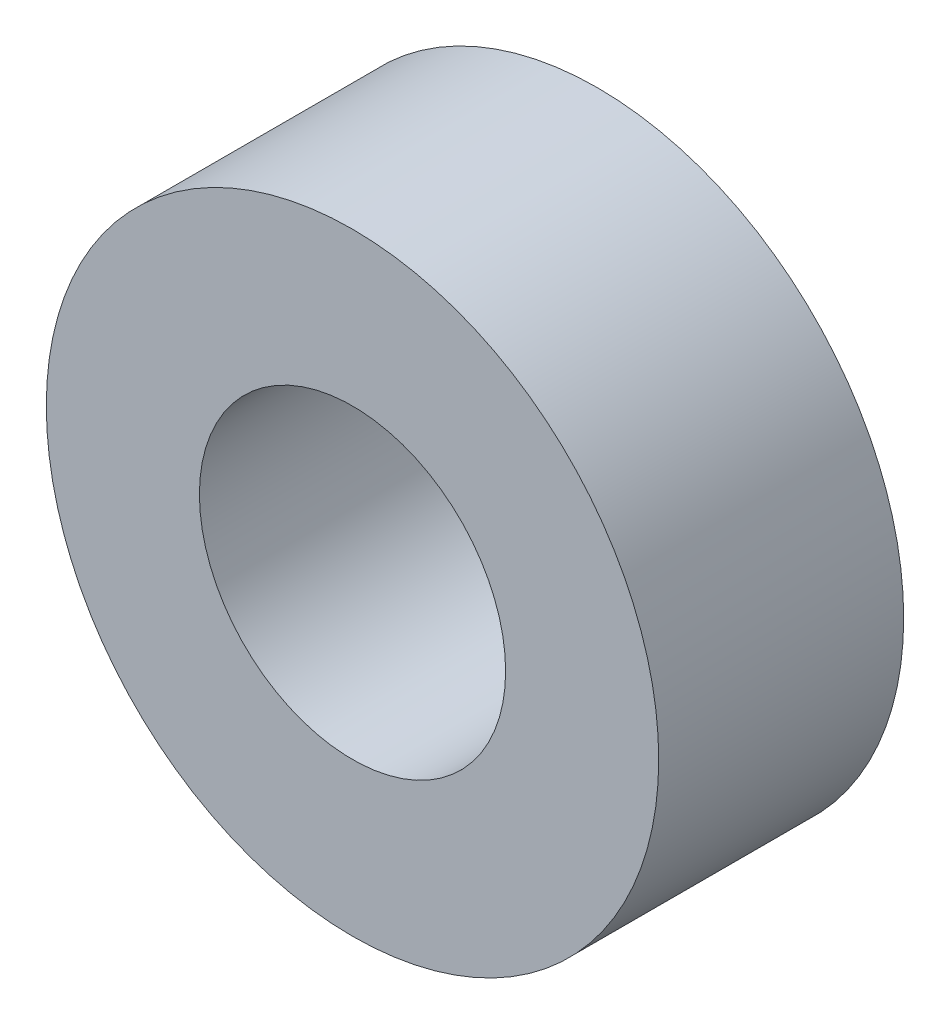
ISO-10303-21;
HEADER;
FILE_DESCRIPTION(('STEP AP214'),'2;1');
FILE_NAME('part.step','',(''),(''),'','','');
FILE_SCHEMA(('AUTOMOTIVE_DESIGN { 1 0 10303 214 1 1 1 1 }'));
ENDSEC;
DATA;
#1=APPLICATION_CONTEXT('core data for automotive mechanical design processes');
#2=APPLICATION_PROTOCOL_DEFINITION('international standard','automotive_design',2000,#1);
#3=PRODUCT_CONTEXT('',#1,'mechanical');
#4=PRODUCT('Part','Part','',(#3));
#5=PRODUCT_RELATED_PRODUCT_CATEGORY('part','',(#4));
#6=PRODUCT_DEFINITION_FORMATION('','',#4);
#7=PRODUCT_DEFINITION_CONTEXT('part definition',#1,'design');
#8=PRODUCT_DEFINITION('design','',#6,#7);
#9=PRODUCT_DEFINITION_SHAPE('','',#8);
#10=(LENGTH_UNIT() NAMED_UNIT(*) SI_UNIT(.MILLI.,.METRE.));
#11=(NAMED_UNIT(*) PLANE_ANGLE_UNIT() SI_UNIT($,.RADIAN.));
#12=(NAMED_UNIT(*) SI_UNIT($,.STERADIAN.) SOLID_ANGLE_UNIT());
#13=UNCERTAINTY_MEASURE_WITH_UNIT(LENGTH_MEASURE(1.E-05),#10,'distance_accuracy_value','');
#14=(GEOMETRIC_REPRESENTATION_CONTEXT(3) GLOBAL_UNCERTAINTY_ASSIGNED_CONTEXT((#13)) GLOBAL_UNIT_ASSIGNED_CONTEXT((#10,
#11,#12)) REPRESENTATION_CONTEXT('',''));
#15=CARTESIAN_POINT('',(0.,0.,0.));
#16=DIRECTION('',(0.,0.,1.));
#17=DIRECTION('',(1.,0.,0.));
#18=AXIS2_PLACEMENT_3D('',#15,#16,#17);
#19=CARTESIAN_POINT('',(0.,0.,0.));
#20=DIRECTION('',(0.,0.,1.));
#21=DIRECTION('',(1.,0.,0.));
#22=AXIS2_PLACEMENT_3D('',#19,#20,#21);
#23=PLANE('',#22);
#24=CARTESIAN_POINT('',(0.,0.,0.));
#25=DIRECTION('',(0.,0.,1.));
#26=DIRECTION('',(1.,0.,0.));
#27=AXIS2_PLACEMENT_3D('',#24,#25,#26);
#28=CIRCLE('',#27,5.);
#29=CARTESIAN_POINT('',(5.,0.,0.));
#30=VERTEX_POINT('',#29);
#31=EDGE_CURVE('E39',#30,#30,#28,.T.);
#32=ORIENTED_EDGE('',*,*,#31,.F.);
#33=EDGE_LOOP('',(#32));
#34=FACE_BOUND('',#33,.T.);
#35=CARTESIAN_POINT('',(0.,0.,0.));
#36=DIRECTION('',(0.,0.,-1.));
#37=DIRECTION('',(-1.,0.,0.));
#38=AXIS2_PLACEMENT_3D('',#35,#36,#37);
#39=CIRCLE('',#38,2.5);
#40=CARTESIAN_POINT('',(-2.5,0.,0.));
#41=VERTEX_POINT('',#40);
#42=EDGE_CURVE('E45',#41,#41,#39,.T.);
#43=ORIENTED_EDGE('',*,*,#42,.F.);
#44=EDGE_LOOP('',(#43));
#45=FACE_BOUND('',#44,.T.);
#46=ADVANCED_FACE('F31',(#34,#45),#23,.F.);
#47=CARTESIAN_POINT('',(0.,0.,4.));
#48=DIRECTION('',(0.,0.,-1.));
#49=DIRECTION('',(-1.,0.,0.));
#50=AXIS2_PLACEMENT_3D('',#47,#48,#49);
#51=CYLINDRICAL_SURFACE('',#50,5.);
#52=CARTESIAN_POINT('',(0.,0.,4.));
#53=DIRECTION('',(0.,0.,1.));
#54=DIRECTION('',(1.,0.,0.));
#55=AXIS2_PLACEMENT_3D('',#52,#53,#54);
#56=CIRCLE('',#55,5.);
#57=CARTESIAN_POINT('',(5.,0.,4.));
#58=VERTEX_POINT('',#57);
#59=EDGE_CURVE('E10',#58,#58,#56,.T.);
#60=ORIENTED_EDGE('',*,*,#59,.F.);
#61=EDGE_LOOP('',(#60));
#62=FACE_BOUND('',#61,.T.);
#63=ORIENTED_EDGE('',*,*,#31,.T.);
#64=EDGE_LOOP('',(#63));
#65=FACE_BOUND('',#64,.T.);
#66=ADVANCED_FACE('F33',(#62,#65),#51,.T.);
#67=CARTESIAN_POINT('',(0.,0.,4.));
#68=DIRECTION('',(0.,0.,1.));
#69=DIRECTION('',(1.,0.,0.));
#70=AXIS2_PLACEMENT_3D('',#67,#68,#69);
#71=PLANE('',#70);
#72=CARTESIAN_POINT('',(0.,0.,4.));
#73=DIRECTION('',(0.,0.,1.));
#74=DIRECTION('',(1.,0.,0.));
#75=AXIS2_PLACEMENT_3D('',#72,#73,#74);
#76=CIRCLE('',#75,2.5);
#77=CARTESIAN_POINT('',(2.5,0.,4.));
#78=VERTEX_POINT('',#77);
#79=EDGE_CURVE('E35',#78,#78,#76,.T.);
#80=ORIENTED_EDGE('',*,*,#79,.F.);
#81=EDGE_LOOP('',(#80));
#82=FACE_BOUND('',#81,.T.);
#83=ORIENTED_EDGE('',*,*,#59,.T.);
#84=EDGE_LOOP('',(#83));
#85=FACE_BOUND('',#84,.T.);
#86=ADVANCED_FACE('F54',(#82,#85),#71,.T.);
#87=CARTESIAN_POINT('',(0.,0.,0.));
#88=DIRECTION('',(0.,0.,-1.));
#89=DIRECTION('',(-1.,0.,0.));
#90=AXIS2_PLACEMENT_3D('',#87,#88,#89);
#91=CYLINDRICAL_SURFACE('',#90,2.5);
#92=ORIENTED_EDGE('',*,*,#79,.T.);
#93=EDGE_LOOP('',(#92));
#94=FACE_BOUND('',#93,.T.);
#95=ORIENTED_EDGE('',*,*,#42,.T.);
#96=EDGE_LOOP('',(#95));
#97=FACE_BOUND('',#96,.T.);
#98=ADVANCED_FACE('F52',(#94,#97),#91,.F.);
#99=CLOSED_SHELL('',(#46,#66,#86,#98));
#100=MANIFOLD_SOLID_BREP('B2',#99);
#101=ADVANCED_BREP_SHAPE_REPRESENTATION('',(#18,#100),#14);
#102=SHAPE_DEFINITION_REPRESENTATION(#9,#101);
ENDSEC;
END-ISO-10303-21;
